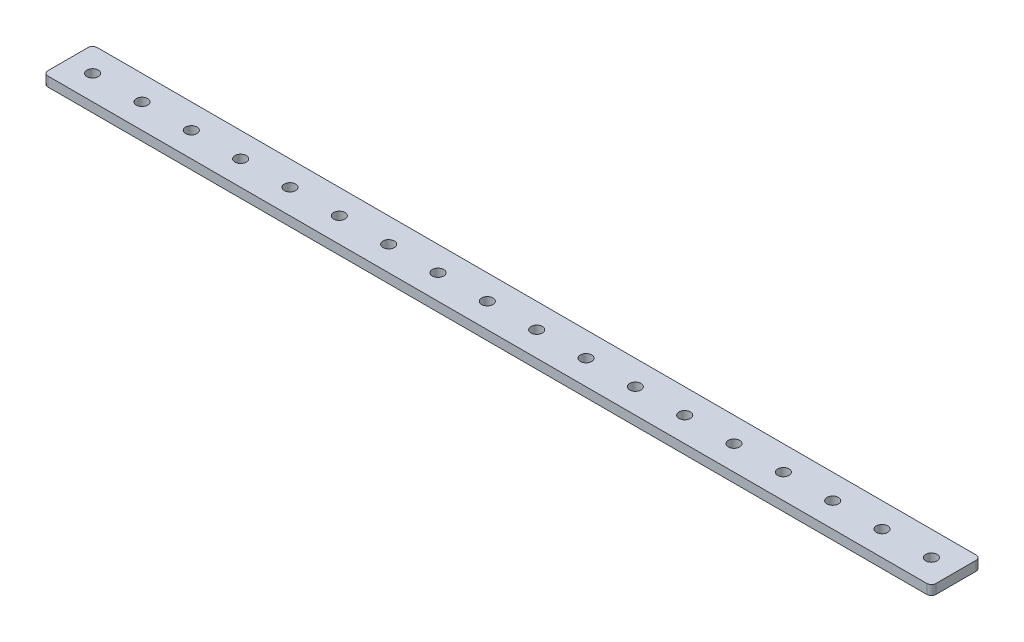
ISO-10303-21;
HEADER;
FILE_DESCRIPTION(('STEP AP214'),'2;1');
FILE_NAME('part.step','',(''),(''),'','','');
FILE_SCHEMA(('AUTOMOTIVE_DESIGN { 1 0 10303 214 1 1 1 1 }'));
ENDSEC;
DATA;
#1=APPLICATION_CONTEXT('core data for automotive mechanical design processes');
#2=APPLICATION_PROTOCOL_DEFINITION('international standard','automotive_design',2000,#1);
#3=PRODUCT_CONTEXT('',#1,'mechanical');
#4=PRODUCT('Part','Part','',(#3));
#5=PRODUCT_RELATED_PRODUCT_CATEGORY('part','',(#4));
#6=PRODUCT_DEFINITION_FORMATION('','',#4);
#7=PRODUCT_DEFINITION_CONTEXT('part definition',#1,'design');
#8=PRODUCT_DEFINITION('design','',#6,#7);
#9=PRODUCT_DEFINITION_SHAPE('','',#8);
#10=(LENGTH_UNIT() NAMED_UNIT(*) SI_UNIT(.MILLI.,.METRE.));
#11=(NAMED_UNIT(*) PLANE_ANGLE_UNIT() SI_UNIT($,.RADIAN.));
#12=(NAMED_UNIT(*) SI_UNIT($,.STERADIAN.) SOLID_ANGLE_UNIT());
#13=UNCERTAINTY_MEASURE_WITH_UNIT(LENGTH_MEASURE(1.E-05),#10,'distance_accuracy_value','');
#14=(GEOMETRIC_REPRESENTATION_CONTEXT(3) GLOBAL_UNCERTAINTY_ASSIGNED_CONTEXT((#13)) GLOBAL_UNIT_ASSIGNED_CONTEXT((#10,
#11,#12)) REPRESENTATION_CONTEXT('',''));
#15=CARTESIAN_POINT('',(0.,0.,0.));
#16=DIRECTION('',(0.,0.,1.));
#17=DIRECTION('',(1.,0.,0.));
#18=AXIS2_PLACEMENT_3D('',#15,#16,#17);
#19=CARTESIAN_POINT('',(-144.,3.1,7.99999999999999));
#20=DIRECTION('',(1.,0.,0.));
#21=DIRECTION('',(0.,0.,-1.));
#22=AXIS2_PLACEMENT_3D('',#19,#20,#21);
#23=PLANE('',#22);
#24=DIRECTION('',(0.,0.,1.));
#25=VECTOR('',#24,1.);
#26=CARTESIAN_POINT('',(-144.,0.,7.99999999999999));
#27=LINE('',#26,#25);
#28=CARTESIAN_POINT('',(-144.,0.,-6.50000000000001));
#29=VERTEX_POINT('',#28);
#30=CARTESIAN_POINT('',(-144.,0.,6.49999999999999));
#31=VERTEX_POINT('',#30);
#32=EDGE_CURVE('E135',#29,#31,#27,.T.);
#33=ORIENTED_EDGE('',*,*,#32,.T.);
#34=DIRECTION('',(0.,-1.,0.));
#35=VECTOR('',#34,1.);
#36=CARTESIAN_POINT('',(-144.,3.1,6.49999999999999));
#37=LINE('',#36,#35);
#38=CARTESIAN_POINT('',(-144.,3.1,6.49999999999999));
#39=VERTEX_POINT('',#38);
#40=EDGE_CURVE('E110',#31,#39,#37,.F.);
#41=ORIENTED_EDGE('',*,*,#40,.T.);
#42=DIRECTION('',(0.,0.,1.));
#43=VECTOR('',#42,1.);
#44=CARTESIAN_POINT('',(-144.,3.1,7.99999999999999));
#45=LINE('',#44,#43);
#46=CARTESIAN_POINT('',(-144.,3.1,-6.50000000000001));
#47=VERTEX_POINT('',#46);
#48=EDGE_CURVE('E150',#47,#39,#45,.T.);
#49=ORIENTED_EDGE('',*,*,#48,.F.);
#50=DIRECTION('',(0.,-1.,0.));
#51=VECTOR('',#50,1.);
#52=CARTESIAN_POINT('',(-144.,3.1,-6.50000000000001));
#53=LINE('',#52,#51);
#54=EDGE_CURVE('E116',#47,#29,#53,.T.);
#55=ORIENTED_EDGE('',*,*,#54,.T.);
#56=EDGE_LOOP('',(#33,#41,#49,#55));
#57=FACE_BOUND('',#56,.T.);
#58=ADVANCED_FACE('F16',(#57),#23,.F.);
#59=CARTESIAN_POINT('',(-144.,3.1,7.99999999999999));
#60=DIRECTION('',(0.,0.,-1.));
#61=DIRECTION('',(-1.,0.,0.));
#62=AXIS2_PLACEMENT_3D('',#59,#60,#61);
#63=PLANE('',#62);
#64=DIRECTION('',(1.,0.,0.));
#65=VECTOR('',#64,1.);
#66=CARTESIAN_POINT('',(-144.,3.1,7.99999999999999));
#67=LINE('',#66,#65);
#68=CARTESIAN_POINT('',(-142.5,3.1,7.99999999999999));
#69=VERTEX_POINT('',#68);
#70=CARTESIAN_POINT('',(142.5,3.1,7.99999999999999));
#71=VERTEX_POINT('',#70);
#72=EDGE_CURVE('E126',#69,#71,#67,.T.);
#73=ORIENTED_EDGE('',*,*,#72,.F.);
#74=DIRECTION('',(0.,-1.,0.));
#75=VECTOR('',#74,1.);
#76=CARTESIAN_POINT('',(-142.5,3.1,7.99999999999999));
#77=LINE('',#76,#75);
#78=CARTESIAN_POINT('',(-142.5,0.,7.99999999999999));
#79=VERTEX_POINT('',#78);
#80=EDGE_CURVE('E109',#69,#79,#77,.T.);
#81=ORIENTED_EDGE('',*,*,#80,.T.);
#82=DIRECTION('',(1.,0.,0.));
#83=VECTOR('',#82,1.);
#84=CARTESIAN_POINT('',(-144.,0.,7.99999999999999));
#85=LINE('',#84,#83);
#86=CARTESIAN_POINT('',(142.5,0.,7.99999999999999));
#87=VERTEX_POINT('',#86);
#88=EDGE_CURVE('E123',#79,#87,#85,.T.);
#89=ORIENTED_EDGE('',*,*,#88,.T.);
#90=DIRECTION('',(0.,-1.,0.));
#91=VECTOR('',#90,1.);
#92=CARTESIAN_POINT('',(142.5,3.1,7.99999999999999));
#93=LINE('',#92,#91);
#94=EDGE_CURVE('E129',#87,#71,#93,.F.);
#95=ORIENTED_EDGE('',*,*,#94,.T.);
#96=EDGE_LOOP('',(#73,#81,#89,#95));
#97=FACE_BOUND('',#96,.T.);
#98=ADVANCED_FACE('F122',(#97),#63,.F.);
#99=CARTESIAN_POINT('',(144.,3.1,7.99999999999999));
#100=DIRECTION('',(-1.,0.,0.));
#101=DIRECTION('',(0.,0.,1.));
#102=AXIS2_PLACEMENT_3D('',#99,#100,#101);
#103=PLANE('',#102);
#104=DIRECTION('',(0.,0.,-1.));
#105=VECTOR('',#104,1.);
#106=CARTESIAN_POINT('',(144.,0.,7.99999999999999));
#107=LINE('',#106,#105);
#108=CARTESIAN_POINT('',(144.,0.,6.49999999999999));
#109=VERTEX_POINT('',#108);
#110=CARTESIAN_POINT('',(144.,0.,-6.50000000000001));
#111=VERTEX_POINT('',#110);
#112=EDGE_CURVE('E134',#109,#111,#107,.T.);
#113=ORIENTED_EDGE('',*,*,#112,.T.);
#114=DIRECTION('',(0.,-1.,0.));
#115=VECTOR('',#114,1.);
#116=CARTESIAN_POINT('',(144.,3.1,-6.50000000000001));
#117=LINE('',#116,#115);
#118=CARTESIAN_POINT('',(144.,3.1,-6.50000000000001));
#119=VERTEX_POINT('',#118);
#120=EDGE_CURVE('E10',#111,#119,#117,.F.);
#121=ORIENTED_EDGE('',*,*,#120,.T.);
#122=DIRECTION('',(0.,0.,-1.));
#123=VECTOR('',#122,1.);
#124=CARTESIAN_POINT('',(144.,3.1,7.99999999999999));
#125=LINE('',#124,#123);
#126=CARTESIAN_POINT('',(144.,3.1,6.49999999999999));
#127=VERTEX_POINT('',#126);
#128=EDGE_CURVE('E190',#127,#119,#125,.T.);
#129=ORIENTED_EDGE('',*,*,#128,.F.);
#130=DIRECTION('',(0.,-1.,0.));
#131=VECTOR('',#130,1.);
#132=CARTESIAN_POINT('',(144.,3.1,6.49999999999999));
#133=LINE('',#132,#131);
#134=EDGE_CURVE('E25',#127,#109,#133,.T.);
#135=ORIENTED_EDGE('',*,*,#134,.T.);
#136=EDGE_LOOP('',(#113,#121,#129,#135));
#137=FACE_BOUND('',#136,.T.);
#138=ADVANCED_FACE('F188',(#137),#103,.F.);
#139=CARTESIAN_POINT('',(-144.,3.1,-8.00000000000001));
#140=DIRECTION('',(0.,0.,1.));
#141=DIRECTION('',(1.,0.,0.));
#142=AXIS2_PLACEMENT_3D('',#139,#140,#141);
#143=PLANE('',#142);
#144=DIRECTION('',(-1.,0.,0.));
#145=VECTOR('',#144,1.);
#146=CARTESIAN_POINT('',(-144.,0.,-8.00000000000001));
#147=LINE('',#146,#145);
#148=CARTESIAN_POINT('',(142.5,0.,-8.00000000000001));
#149=VERTEX_POINT('',#148);
#150=CARTESIAN_POINT('',(-142.5,0.,-8.00000000000001));
#151=VERTEX_POINT('',#150);
#152=EDGE_CURVE('E142',#149,#151,#147,.T.);
#153=ORIENTED_EDGE('',*,*,#152,.T.);
#154=DIRECTION('',(0.,-1.,0.));
#155=VECTOR('',#154,1.);
#156=CARTESIAN_POINT('',(-142.5,3.1,-8.00000000000001));
#157=LINE('',#156,#155);
#158=CARTESIAN_POINT('',(-142.5,3.1,-8.00000000000001));
#159=VERTEX_POINT('',#158);
#160=EDGE_CURVE('E37',#151,#159,#157,.F.);
#161=ORIENTED_EDGE('',*,*,#160,.T.);
#162=DIRECTION('',(-1.,0.,0.));
#163=VECTOR('',#162,1.);
#164=CARTESIAN_POINT('',(-144.,3.1,-8.00000000000001));
#165=LINE('',#164,#163);
#166=CARTESIAN_POINT('',(142.5,3.1,-8.00000000000001));
#167=VERTEX_POINT('',#166);
#168=EDGE_CURVE('E152',#167,#159,#165,.T.);
#169=ORIENTED_EDGE('',*,*,#168,.F.);
#170=DIRECTION('',(0.,-1.,0.));
#171=VECTOR('',#170,1.);
#172=CARTESIAN_POINT('',(142.5,3.1,-8.00000000000001));
#173=LINE('',#172,#171);
#174=EDGE_CURVE('E177',#167,#149,#173,.T.);
#175=ORIENTED_EDGE('',*,*,#174,.T.);
#176=EDGE_LOOP('',(#153,#161,#169,#175));
#177=FACE_BOUND('',#176,.T.);
#178=ADVANCED_FACE('F197',(#177),#143,.F.);
#179=CARTESIAN_POINT('',(-144.,3.1,-8.00000000000001));
#180=DIRECTION('',(0.,-1.,0.));
#181=DIRECTION('',(0.,0.,-1.));
#182=AXIS2_PLACEMENT_3D('',#179,#180,#181);
#183=PLANE('',#182);
#184=CARTESIAN_POINT('',(136.,3.1,0.));
#185=DIRECTION('',(0.,1.,0.));
#186=DIRECTION('',(0.,0.,1.));
#187=AXIS2_PLACEMENT_3D('',#184,#185,#186);
#188=CIRCLE('',#187,1.85);
#189=CARTESIAN_POINT('',(136.,3.1,1.85));
#190=VERTEX_POINT('',#189);
#191=EDGE_CURVE('E343',#190,#190,#188,.T.);
#192=ORIENTED_EDGE('',*,*,#191,.F.);
#193=EDGE_LOOP('',(#192));
#194=FACE_BOUND('',#193,.T.);
#195=CARTESIAN_POINT('',(120.,3.1,0.));
#196=DIRECTION('',(0.,1.,0.));
#197=DIRECTION('',(0.,0.,1.));
#198=AXIS2_PLACEMENT_3D('',#195,#196,#197);
#199=CIRCLE('',#198,1.85);
#200=CARTESIAN_POINT('',(120.,3.1,1.85));
#201=VERTEX_POINT('',#200);
#202=EDGE_CURVE('E335',#201,#201,#199,.T.);
#203=ORIENTED_EDGE('',*,*,#202,.F.);
#204=EDGE_LOOP('',(#203));
#205=FACE_BOUND('',#204,.T.);
#206=CARTESIAN_POINT('',(104.,3.1,0.));
#207=DIRECTION('',(0.,1.,0.));
#208=DIRECTION('',(0.,0.,1.));
#209=AXIS2_PLACEMENT_3D('',#206,#207,#208);
#210=CIRCLE('',#209,1.85);
#211=CARTESIAN_POINT('',(104.,3.1,1.85));
#212=VERTEX_POINT('',#211);
#213=EDGE_CURVE('E327',#212,#212,#210,.T.);
#214=ORIENTED_EDGE('',*,*,#213,.F.);
#215=EDGE_LOOP('',(#214));
#216=FACE_BOUND('',#215,.T.);
#217=CARTESIAN_POINT('',(88.,3.1,0.));
#218=DIRECTION('',(0.,1.,0.));
#219=DIRECTION('',(0.,0.,1.));
#220=AXIS2_PLACEMENT_3D('',#217,#218,#219);
#221=CIRCLE('',#220,1.85);
#222=CARTESIAN_POINT('',(88.,3.1,1.85));
#223=VERTEX_POINT('',#222);
#224=EDGE_CURVE('E319',#223,#223,#221,.T.);
#225=ORIENTED_EDGE('',*,*,#224,.F.);
#226=EDGE_LOOP('',(#225));
#227=FACE_BOUND('',#226,.T.);
#228=CARTESIAN_POINT('',(72.,3.1,0.));
#229=DIRECTION('',(0.,1.,0.));
#230=DIRECTION('',(0.,0.,1.));
#231=AXIS2_PLACEMENT_3D('',#228,#229,#230);
#232=CIRCLE('',#231,1.85);
#233=CARTESIAN_POINT('',(72.,3.1,1.85));
#234=VERTEX_POINT('',#233);
#235=EDGE_CURVE('E311',#234,#234,#232,.T.);
#236=ORIENTED_EDGE('',*,*,#235,.F.);
#237=EDGE_LOOP('',(#236));
#238=FACE_BOUND('',#237,.T.);
#239=CARTESIAN_POINT('',(56.,3.1,0.));
#240=DIRECTION('',(0.,1.,0.));
#241=DIRECTION('',(0.,0.,1.));
#242=AXIS2_PLACEMENT_3D('',#239,#240,#241);
#243=CIRCLE('',#242,1.85);
#244=CARTESIAN_POINT('',(56.,3.1,1.85));
#245=VERTEX_POINT('',#244);
#246=EDGE_CURVE('E303',#245,#245,#243,.T.);
#247=ORIENTED_EDGE('',*,*,#246,.F.);
#248=EDGE_LOOP('',(#247));
#249=FACE_BOUND('',#248,.T.);
#250=CARTESIAN_POINT('',(40.,3.1,0.));
#251=DIRECTION('',(0.,1.,0.));
#252=DIRECTION('',(0.,0.,1.));
#253=AXIS2_PLACEMENT_3D('',#250,#251,#252);
#254=CIRCLE('',#253,1.85);
#255=CARTESIAN_POINT('',(40.,3.1,1.85));
#256=VERTEX_POINT('',#255);
#257=EDGE_CURVE('E295',#256,#256,#254,.T.);
#258=ORIENTED_EDGE('',*,*,#257,.F.);
#259=EDGE_LOOP('',(#258));
#260=FACE_BOUND('',#259,.T.);
#261=CARTESIAN_POINT('',(24.,3.1,0.));
#262=DIRECTION('',(0.,1.,0.));
#263=DIRECTION('',(0.,0.,1.));
#264=AXIS2_PLACEMENT_3D('',#261,#262,#263);
#265=CIRCLE('',#264,1.85);
#266=CARTESIAN_POINT('',(24.,3.1,1.85));
#267=VERTEX_POINT('',#266);
#268=EDGE_CURVE('E287',#267,#267,#265,.T.);
#269=ORIENTED_EDGE('',*,*,#268,.F.);
#270=EDGE_LOOP('',(#269));
#271=FACE_BOUND('',#270,.T.);
#272=CARTESIAN_POINT('',(8.00000000000004,3.1,0.));
#273=DIRECTION('',(0.,1.,0.));
#274=DIRECTION('',(0.,0.,1.));
#275=AXIS2_PLACEMENT_3D('',#272,#273,#274);
#276=CIRCLE('',#275,1.85);
#277=CARTESIAN_POINT('',(8.00000000000004,3.1,1.85));
#278=VERTEX_POINT('',#277);
#279=EDGE_CURVE('E279',#278,#278,#276,.T.);
#280=ORIENTED_EDGE('',*,*,#279,.F.);
#281=EDGE_LOOP('',(#280));
#282=FACE_BOUND('',#281,.T.);
#283=CARTESIAN_POINT('',(-7.99999999999998,3.1,0.));
#284=DIRECTION('',(0.,1.,0.));
#285=DIRECTION('',(0.,0.,1.));
#286=AXIS2_PLACEMENT_3D('',#283,#284,#285);
#287=CIRCLE('',#286,1.85);
#288=CARTESIAN_POINT('',(-7.99999999999998,3.1,1.85));
#289=VERTEX_POINT('',#288);
#290=EDGE_CURVE('E271',#289,#289,#287,.T.);
#291=ORIENTED_EDGE('',*,*,#290,.F.);
#292=EDGE_LOOP('',(#291));
#293=FACE_BOUND('',#292,.T.);
#294=CARTESIAN_POINT('',(-24.,3.1,0.));
#295=DIRECTION('',(0.,1.,0.));
#296=DIRECTION('',(0.,0.,1.));
#297=AXIS2_PLACEMENT_3D('',#294,#295,#296);
#298=CIRCLE('',#297,1.85);
#299=CARTESIAN_POINT('',(-24.,3.1,1.85));
#300=VERTEX_POINT('',#299);
#301=EDGE_CURVE('E263',#300,#300,#298,.T.);
#302=ORIENTED_EDGE('',*,*,#301,.F.);
#303=EDGE_LOOP('',(#302));
#304=FACE_BOUND('',#303,.T.);
#305=CARTESIAN_POINT('',(-40.,3.1,0.));
#306=DIRECTION('',(0.,1.,0.));
#307=DIRECTION('',(0.,0.,1.));
#308=AXIS2_PLACEMENT_3D('',#305,#306,#307);
#309=CIRCLE('',#308,1.85);
#310=CARTESIAN_POINT('',(-40.,3.1,1.85));
#311=VERTEX_POINT('',#310);
#312=EDGE_CURVE('E255',#311,#311,#309,.T.);
#313=ORIENTED_EDGE('',*,*,#312,.F.);
#314=EDGE_LOOP('',(#313));
#315=FACE_BOUND('',#314,.T.);
#316=CARTESIAN_POINT('',(-56.,3.1,0.));
#317=DIRECTION('',(0.,1.,0.));
#318=DIRECTION('',(0.,0.,1.));
#319=AXIS2_PLACEMENT_3D('',#316,#317,#318);
#320=CIRCLE('',#319,1.85);
#321=CARTESIAN_POINT('',(-56.,3.1,1.85));
#322=VERTEX_POINT('',#321);
#323=EDGE_CURVE('E247',#322,#322,#320,.T.);
#324=ORIENTED_EDGE('',*,*,#323,.F.);
#325=EDGE_LOOP('',(#324));
#326=FACE_BOUND('',#325,.T.);
#327=CARTESIAN_POINT('',(-72.,3.1,0.));
#328=DIRECTION('',(0.,1.,0.));
#329=DIRECTION('',(0.,0.,1.));
#330=AXIS2_PLACEMENT_3D('',#327,#328,#329);
#331=CIRCLE('',#330,1.85);
#332=CARTESIAN_POINT('',(-72.,3.1,1.85));
#333=VERTEX_POINT('',#332);
#334=EDGE_CURVE('E239',#333,#333,#331,.T.);
#335=ORIENTED_EDGE('',*,*,#334,.F.);
#336=EDGE_LOOP('',(#335));
#337=FACE_BOUND('',#336,.T.);
#338=CARTESIAN_POINT('',(-88.,3.1,0.));
#339=DIRECTION('',(0.,1.,0.));
#340=DIRECTION('',(0.,0.,1.));
#341=AXIS2_PLACEMENT_3D('',#338,#339,#340);
#342=CIRCLE('',#341,1.85);
#343=CARTESIAN_POINT('',(-88.,3.1,1.85));
#344=VERTEX_POINT('',#343);
#345=EDGE_CURVE('E231',#344,#344,#342,.T.);
#346=ORIENTED_EDGE('',*,*,#345,.F.);
#347=EDGE_LOOP('',(#346));
#348=FACE_BOUND('',#347,.T.);
#349=CARTESIAN_POINT('',(-104.,3.1,0.));
#350=DIRECTION('',(0.,1.,0.));
#351=DIRECTION('',(0.,0.,1.));
#352=AXIS2_PLACEMENT_3D('',#349,#350,#351);
#353=CIRCLE('',#352,1.85);
#354=CARTESIAN_POINT('',(-104.,3.1,1.85));
#355=VERTEX_POINT('',#354);
#356=EDGE_CURVE('E223',#355,#355,#353,.T.);
#357=ORIENTED_EDGE('',*,*,#356,.F.);
#358=EDGE_LOOP('',(#357));
#359=FACE_BOUND('',#358,.T.);
#360=CARTESIAN_POINT('',(-120.,3.1,0.));
#361=DIRECTION('',(0.,1.,0.));
#362=DIRECTION('',(0.,0.,1.));
#363=AXIS2_PLACEMENT_3D('',#360,#361,#362);
#364=CIRCLE('',#363,1.85);
#365=CARTESIAN_POINT('',(-120.,3.1,1.85));
#366=VERTEX_POINT('',#365);
#367=EDGE_CURVE('E215',#366,#366,#364,.T.);
#368=ORIENTED_EDGE('',*,*,#367,.F.);
#369=EDGE_LOOP('',(#368));
#370=FACE_BOUND('',#369,.T.);
#371=CARTESIAN_POINT('',(-136.,3.1,0.));
#372=DIRECTION('',(0.,1.,0.));
#373=DIRECTION('',(0.,0.,1.));
#374=AXIS2_PLACEMENT_3D('',#371,#372,#373);
#375=CIRCLE('',#374,1.85);
#376=CARTESIAN_POINT('',(-136.,3.1,1.85));
#377=VERTEX_POINT('',#376);
#378=EDGE_CURVE('E144',#377,#377,#375,.T.);
#379=ORIENTED_EDGE('',*,*,#378,.F.);
#380=EDGE_LOOP('',(#379));
#381=FACE_BOUND('',#380,.T.);
#382=ORIENTED_EDGE('',*,*,#48,.T.);
#383=CARTESIAN_POINT('',(-142.5,3.1,6.49999999999999));
#384=DIRECTION('',(0.,-1.,0.));
#385=DIRECTION('',(0.,0.,-1.));
#386=AXIS2_PLACEMENT_3D('',#383,#384,#385);
#387=CIRCLE('',#386,1.5);
#388=EDGE_CURVE('E174',#39,#69,#387,.F.);
#389=ORIENTED_EDGE('',*,*,#388,.T.);
#390=ORIENTED_EDGE('',*,*,#72,.T.);
#391=CARTESIAN_POINT('',(142.5,3.1,6.49999999999999));
#392=DIRECTION('',(0.,-1.,0.));
#393=DIRECTION('',(0.,0.,-1.));
#394=AXIS2_PLACEMENT_3D('',#391,#392,#393);
#395=CIRCLE('',#394,1.5);
#396=EDGE_CURVE('E166',#71,#127,#395,.F.);
#397=ORIENTED_EDGE('',*,*,#396,.T.);
#398=ORIENTED_EDGE('',*,*,#128,.T.);
#399=CARTESIAN_POINT('',(142.5,3.1,-6.50000000000001));
#400=DIRECTION('',(0.,-1.,0.));
#401=DIRECTION('',(0.,0.,-1.));
#402=AXIS2_PLACEMENT_3D('',#399,#400,#401);
#403=CIRCLE('',#402,1.5);
#404=EDGE_CURVE('E46',#119,#167,#403,.F.);
#405=ORIENTED_EDGE('',*,*,#404,.T.);
#406=ORIENTED_EDGE('',*,*,#168,.T.);
#407=CARTESIAN_POINT('',(-142.5,3.1,-6.50000000000001));
#408=DIRECTION('',(0.,-1.,0.));
#409=DIRECTION('',(0.,0.,-1.));
#410=AXIS2_PLACEMENT_3D('',#407,#408,#409);
#411=CIRCLE('',#410,1.5);
#412=EDGE_CURVE('E171',#159,#47,#411,.F.);
#413=ORIENTED_EDGE('',*,*,#412,.T.);
#414=EDGE_LOOP('',(#382,#389,#390,#397,#398,#405,#406,#413));
#415=FACE_BOUND('',#414,.T.);
#416=ADVANCED_FACE('F364',(#194,#205,#216,#227,#238,#249,#260,#271,#282,#293,#304,#315,#326,
#337,#348,#359,#370,#381,#415),#183,.F.);
#417=CARTESIAN_POINT('',(-144.,0.,-8.00000000000001));
#418=DIRECTION('',(0.,-1.,0.));
#419=DIRECTION('',(0.,0.,-1.));
#420=AXIS2_PLACEMENT_3D('',#417,#418,#419);
#421=PLANE('',#420);
#422=CARTESIAN_POINT('',(136.,0.,0.));
#423=DIRECTION('',(0.,1.,0.));
#424=DIRECTION('',(0.,0.,1.));
#425=AXIS2_PLACEMENT_3D('',#422,#423,#424);
#426=CIRCLE('',#425,1.85);
#427=CARTESIAN_POINT('',(136.,0.,1.85));
#428=VERTEX_POINT('',#427);
#429=EDGE_CURVE('E347',#428,#428,#426,.T.);
#430=ORIENTED_EDGE('',*,*,#429,.T.);
#431=EDGE_LOOP('',(#430));
#432=FACE_BOUND('',#431,.T.);
#433=CARTESIAN_POINT('',(120.,0.,0.));
#434=DIRECTION('',(0.,1.,0.));
#435=DIRECTION('',(0.,0.,1.));
#436=AXIS2_PLACEMENT_3D('',#433,#434,#435);
#437=CIRCLE('',#436,1.85);
#438=CARTESIAN_POINT('',(120.,0.,1.85));
#439=VERTEX_POINT('',#438);
#440=EDGE_CURVE('E339',#439,#439,#437,.T.);
#441=ORIENTED_EDGE('',*,*,#440,.T.);
#442=EDGE_LOOP('',(#441));
#443=FACE_BOUND('',#442,.T.);
#444=CARTESIAN_POINT('',(104.,0.,0.));
#445=DIRECTION('',(0.,1.,0.));
#446=DIRECTION('',(0.,0.,1.));
#447=AXIS2_PLACEMENT_3D('',#444,#445,#446);
#448=CIRCLE('',#447,1.85);
#449=CARTESIAN_POINT('',(104.,0.,1.85));
#450=VERTEX_POINT('',#449);
#451=EDGE_CURVE('E331',#450,#450,#448,.T.);
#452=ORIENTED_EDGE('',*,*,#451,.T.);
#453=EDGE_LOOP('',(#452));
#454=FACE_BOUND('',#453,.T.);
#455=CARTESIAN_POINT('',(88.,0.,0.));
#456=DIRECTION('',(0.,1.,0.));
#457=DIRECTION('',(0.,0.,1.));
#458=AXIS2_PLACEMENT_3D('',#455,#456,#457);
#459=CIRCLE('',#458,1.85);
#460=CARTESIAN_POINT('',(88.,0.,1.85));
#461=VERTEX_POINT('',#460);
#462=EDGE_CURVE('E323',#461,#461,#459,.T.);
#463=ORIENTED_EDGE('',*,*,#462,.T.);
#464=EDGE_LOOP('',(#463));
#465=FACE_BOUND('',#464,.T.);
#466=CARTESIAN_POINT('',(72.,0.,0.));
#467=DIRECTION('',(0.,1.,0.));
#468=DIRECTION('',(0.,0.,1.));
#469=AXIS2_PLACEMENT_3D('',#466,#467,#468);
#470=CIRCLE('',#469,1.85);
#471=CARTESIAN_POINT('',(72.,0.,1.85));
#472=VERTEX_POINT('',#471);
#473=EDGE_CURVE('E315',#472,#472,#470,.T.);
#474=ORIENTED_EDGE('',*,*,#473,.T.);
#475=EDGE_LOOP('',(#474));
#476=FACE_BOUND('',#475,.T.);
#477=CARTESIAN_POINT('',(56.,0.,0.));
#478=DIRECTION('',(0.,1.,0.));
#479=DIRECTION('',(0.,0.,1.));
#480=AXIS2_PLACEMENT_3D('',#477,#478,#479);
#481=CIRCLE('',#480,1.85);
#482=CARTESIAN_POINT('',(56.,0.,1.85));
#483=VERTEX_POINT('',#482);
#484=EDGE_CURVE('E307',#483,#483,#481,.T.);
#485=ORIENTED_EDGE('',*,*,#484,.T.);
#486=EDGE_LOOP('',(#485));
#487=FACE_BOUND('',#486,.T.);
#488=CARTESIAN_POINT('',(40.,0.,0.));
#489=DIRECTION('',(0.,1.,0.));
#490=DIRECTION('',(0.,0.,1.));
#491=AXIS2_PLACEMENT_3D('',#488,#489,#490);
#492=CIRCLE('',#491,1.85);
#493=CARTESIAN_POINT('',(40.,0.,1.85));
#494=VERTEX_POINT('',#493);
#495=EDGE_CURVE('E299',#494,#494,#492,.T.);
#496=ORIENTED_EDGE('',*,*,#495,.T.);
#497=EDGE_LOOP('',(#496));
#498=FACE_BOUND('',#497,.T.);
#499=CARTESIAN_POINT('',(24.,0.,0.));
#500=DIRECTION('',(0.,1.,0.));
#501=DIRECTION('',(0.,0.,1.));
#502=AXIS2_PLACEMENT_3D('',#499,#500,#501);
#503=CIRCLE('',#502,1.85);
#504=CARTESIAN_POINT('',(24.,0.,1.85));
#505=VERTEX_POINT('',#504);
#506=EDGE_CURVE('E291',#505,#505,#503,.T.);
#507=ORIENTED_EDGE('',*,*,#506,.T.);
#508=EDGE_LOOP('',(#507));
#509=FACE_BOUND('',#508,.T.);
#510=CARTESIAN_POINT('',(8.00000000000004,0.,0.));
#511=DIRECTION('',(0.,1.,0.));
#512=DIRECTION('',(0.,0.,1.));
#513=AXIS2_PLACEMENT_3D('',#510,#511,#512);
#514=CIRCLE('',#513,1.85);
#515=CARTESIAN_POINT('',(8.00000000000004,0.,1.85));
#516=VERTEX_POINT('',#515);
#517=EDGE_CURVE('E283',#516,#516,#514,.T.);
#518=ORIENTED_EDGE('',*,*,#517,.T.);
#519=EDGE_LOOP('',(#518));
#520=FACE_BOUND('',#519,.T.);
#521=CARTESIAN_POINT('',(-7.99999999999998,0.,0.));
#522=DIRECTION('',(0.,1.,0.));
#523=DIRECTION('',(0.,0.,1.));
#524=AXIS2_PLACEMENT_3D('',#521,#522,#523);
#525=CIRCLE('',#524,1.85);
#526=CARTESIAN_POINT('',(-7.99999999999998,0.,1.85));
#527=VERTEX_POINT('',#526);
#528=EDGE_CURVE('E275',#527,#527,#525,.T.);
#529=ORIENTED_EDGE('',*,*,#528,.T.);
#530=EDGE_LOOP('',(#529));
#531=FACE_BOUND('',#530,.T.);
#532=CARTESIAN_POINT('',(-24.,0.,0.));
#533=DIRECTION('',(0.,1.,0.));
#534=DIRECTION('',(0.,0.,1.));
#535=AXIS2_PLACEMENT_3D('',#532,#533,#534);
#536=CIRCLE('',#535,1.85);
#537=CARTESIAN_POINT('',(-24.,0.,1.85));
#538=VERTEX_POINT('',#537);
#539=EDGE_CURVE('E267',#538,#538,#536,.T.);
#540=ORIENTED_EDGE('',*,*,#539,.T.);
#541=EDGE_LOOP('',(#540));
#542=FACE_BOUND('',#541,.T.);
#543=CARTESIAN_POINT('',(-40.,0.,0.));
#544=DIRECTION('',(0.,1.,0.));
#545=DIRECTION('',(0.,0.,1.));
#546=AXIS2_PLACEMENT_3D('',#543,#544,#545);
#547=CIRCLE('',#546,1.85);
#548=CARTESIAN_POINT('',(-40.,0.,1.85));
#549=VERTEX_POINT('',#548);
#550=EDGE_CURVE('E259',#549,#549,#547,.T.);
#551=ORIENTED_EDGE('',*,*,#550,.T.);
#552=EDGE_LOOP('',(#551));
#553=FACE_BOUND('',#552,.T.);
#554=CARTESIAN_POINT('',(-56.,0.,0.));
#555=DIRECTION('',(0.,1.,0.));
#556=DIRECTION('',(0.,0.,1.));
#557=AXIS2_PLACEMENT_3D('',#554,#555,#556);
#558=CIRCLE('',#557,1.85);
#559=CARTESIAN_POINT('',(-56.,0.,1.85));
#560=VERTEX_POINT('',#559);
#561=EDGE_CURVE('E251',#560,#560,#558,.T.);
#562=ORIENTED_EDGE('',*,*,#561,.T.);
#563=EDGE_LOOP('',(#562));
#564=FACE_BOUND('',#563,.T.);
#565=CARTESIAN_POINT('',(-72.,0.,0.));
#566=DIRECTION('',(0.,1.,0.));
#567=DIRECTION('',(0.,0.,1.));
#568=AXIS2_PLACEMENT_3D('',#565,#566,#567);
#569=CIRCLE('',#568,1.85);
#570=CARTESIAN_POINT('',(-72.,0.,1.85));
#571=VERTEX_POINT('',#570);
#572=EDGE_CURVE('E243',#571,#571,#569,.T.);
#573=ORIENTED_EDGE('',*,*,#572,.T.);
#574=EDGE_LOOP('',(#573));
#575=FACE_BOUND('',#574,.T.);
#576=CARTESIAN_POINT('',(-88.,0.,0.));
#577=DIRECTION('',(0.,1.,0.));
#578=DIRECTION('',(0.,0.,1.));
#579=AXIS2_PLACEMENT_3D('',#576,#577,#578);
#580=CIRCLE('',#579,1.85);
#581=CARTESIAN_POINT('',(-88.,0.,1.85));
#582=VERTEX_POINT('',#581);
#583=EDGE_CURVE('E235',#582,#582,#580,.T.);
#584=ORIENTED_EDGE('',*,*,#583,.T.);
#585=EDGE_LOOP('',(#584));
#586=FACE_BOUND('',#585,.T.);
#587=CARTESIAN_POINT('',(-104.,0.,0.));
#588=DIRECTION('',(0.,1.,0.));
#589=DIRECTION('',(0.,0.,1.));
#590=AXIS2_PLACEMENT_3D('',#587,#588,#589);
#591=CIRCLE('',#590,1.85);
#592=CARTESIAN_POINT('',(-104.,0.,1.85));
#593=VERTEX_POINT('',#592);
#594=EDGE_CURVE('E227',#593,#593,#591,.T.);
#595=ORIENTED_EDGE('',*,*,#594,.T.);
#596=EDGE_LOOP('',(#595));
#597=FACE_BOUND('',#596,.T.);
#598=CARTESIAN_POINT('',(-120.,0.,0.));
#599=DIRECTION('',(0.,1.,0.));
#600=DIRECTION('',(0.,0.,1.));
#601=AXIS2_PLACEMENT_3D('',#598,#599,#600);
#602=CIRCLE('',#601,1.85);
#603=CARTESIAN_POINT('',(-120.,0.,1.85));
#604=VERTEX_POINT('',#603);
#605=EDGE_CURVE('E219',#604,#604,#602,.T.);
#606=ORIENTED_EDGE('',*,*,#605,.T.);
#607=EDGE_LOOP('',(#606));
#608=FACE_BOUND('',#607,.T.);
#609=CARTESIAN_POINT('',(-136.,0.,0.));
#610=DIRECTION('',(0.,1.,0.));
#611=DIRECTION('',(0.,0.,1.));
#612=AXIS2_PLACEMENT_3D('',#609,#610,#611);
#613=CIRCLE('',#612,1.85);
#614=CARTESIAN_POINT('',(-136.,0.,1.85));
#615=VERTEX_POINT('',#614);
#616=EDGE_CURVE('E211',#615,#615,#613,.T.);
#617=ORIENTED_EDGE('',*,*,#616,.T.);
#618=EDGE_LOOP('',(#617));
#619=FACE_BOUND('',#618,.T.);
#620=ORIENTED_EDGE('',*,*,#88,.F.);
#621=CARTESIAN_POINT('',(-142.5,0.,6.49999999999999));
#622=DIRECTION('',(0.,-1.,0.));
#623=DIRECTION('',(0.,0.,-1.));
#624=AXIS2_PLACEMENT_3D('',#621,#622,#623);
#625=CIRCLE('',#624,1.5);
#626=EDGE_CURVE('E105',#79,#31,#625,.T.);
#627=ORIENTED_EDGE('',*,*,#626,.T.);
#628=ORIENTED_EDGE('',*,*,#32,.F.);
#629=CARTESIAN_POINT('',(-142.5,0.,-6.50000000000001));
#630=DIRECTION('',(0.,-1.,0.));
#631=DIRECTION('',(0.,0.,-1.));
#632=AXIS2_PLACEMENT_3D('',#629,#630,#631);
#633=CIRCLE('',#632,1.5);
#634=EDGE_CURVE('E117',#29,#151,#633,.T.);
#635=ORIENTED_EDGE('',*,*,#634,.T.);
#636=ORIENTED_EDGE('',*,*,#152,.F.);
#637=CARTESIAN_POINT('',(142.5,0.,-6.50000000000001));
#638=DIRECTION('',(0.,-1.,0.));
#639=DIRECTION('',(0.,0.,-1.));
#640=AXIS2_PLACEMENT_3D('',#637,#638,#639);
#641=CIRCLE('',#640,1.5);
#642=EDGE_CURVE('E156',#149,#111,#641,.T.);
#643=ORIENTED_EDGE('',*,*,#642,.T.);
#644=ORIENTED_EDGE('',*,*,#112,.F.);
#645=CARTESIAN_POINT('',(142.5,0.,6.49999999999999));
#646=DIRECTION('',(0.,-1.,0.));
#647=DIRECTION('',(0.,0.,-1.));
#648=AXIS2_PLACEMENT_3D('',#645,#646,#647);
#649=CIRCLE('',#648,1.5);
#650=EDGE_CURVE('E128',#109,#87,#649,.T.);
#651=ORIENTED_EDGE('',*,*,#650,.T.);
#652=EDGE_LOOP('',(#620,#627,#628,#635,#636,#643,#644,#651));
#653=FACE_BOUND('',#652,.T.);
#654=ADVANCED_FACE('F131',(#432,#443,#454,#465,#476,#487,#498,#509,#520,#531,#542,#553,#564,
#575,#586,#597,#608,#619,#653),#421,.T.);
#655=CARTESIAN_POINT('',(-142.5,3.1,6.49999999999999));
#656=DIRECTION('',(0.,-1.,0.));
#657=DIRECTION('',(0.,0.,-1.));
#658=AXIS2_PLACEMENT_3D('',#655,#656,#657);
#659=CYLINDRICAL_SURFACE('',#658,1.5);
#660=ORIENTED_EDGE('',*,*,#388,.F.);
#661=ORIENTED_EDGE('',*,*,#40,.F.);
#662=ORIENTED_EDGE('',*,*,#626,.F.);
#663=ORIENTED_EDGE('',*,*,#80,.F.);
#664=EDGE_LOOP('',(#660,#661,#662,#663));
#665=FACE_BOUND('',#664,.T.);
#666=ADVANCED_FACE('F108',(#665),#659,.T.);
#667=CARTESIAN_POINT('',(-142.5,3.1,-6.50000000000001));
#668=DIRECTION('',(0.,-1.,0.));
#669=DIRECTION('',(0.,0.,-1.));
#670=AXIS2_PLACEMENT_3D('',#667,#668,#669);
#671=CYLINDRICAL_SURFACE('',#670,1.5);
#672=ORIENTED_EDGE('',*,*,#412,.F.);
#673=ORIENTED_EDGE('',*,*,#160,.F.);
#674=ORIENTED_EDGE('',*,*,#634,.F.);
#675=ORIENTED_EDGE('',*,*,#54,.F.);
#676=EDGE_LOOP('',(#672,#673,#674,#675));
#677=FACE_BOUND('',#676,.T.);
#678=ADVANCED_FACE('F405',(#677),#671,.T.);
#679=CARTESIAN_POINT('',(142.5,3.1,-6.50000000000001));
#680=DIRECTION('',(0.,-1.,0.));
#681=DIRECTION('',(0.,0.,-1.));
#682=AXIS2_PLACEMENT_3D('',#679,#680,#681);
#683=CYLINDRICAL_SURFACE('',#682,1.5);
#684=ORIENTED_EDGE('',*,*,#404,.F.);
#685=ORIENTED_EDGE('',*,*,#120,.F.);
#686=ORIENTED_EDGE('',*,*,#642,.F.);
#687=ORIENTED_EDGE('',*,*,#174,.F.);
#688=EDGE_LOOP('',(#684,#685,#686,#687));
#689=FACE_BOUND('',#688,.T.);
#690=ADVANCED_FACE('F196',(#689),#683,.T.);
#691=CARTESIAN_POINT('',(142.5,3.1,6.49999999999999));
#692=DIRECTION('',(0.,-1.,0.));
#693=DIRECTION('',(0.,0.,-1.));
#694=AXIS2_PLACEMENT_3D('',#691,#692,#693);
#695=CYLINDRICAL_SURFACE('',#694,1.5);
#696=ORIENTED_EDGE('',*,*,#396,.F.);
#697=ORIENTED_EDGE('',*,*,#94,.F.);
#698=ORIENTED_EDGE('',*,*,#650,.F.);
#699=ORIENTED_EDGE('',*,*,#134,.F.);
#700=EDGE_LOOP('',(#696,#697,#698,#699));
#701=FACE_BOUND('',#700,.T.);
#702=ADVANCED_FACE('F18',(#701),#695,.T.);
#703=CARTESIAN_POINT('',(-136.,0.,0.));
#704=DIRECTION('',(0.,1.,0.));
#705=DIRECTION('',(0.,0.,1.));
#706=AXIS2_PLACEMENT_3D('',#703,#704,#705);
#707=CYLINDRICAL_SURFACE('',#706,1.85);
#708=ORIENTED_EDGE('',*,*,#616,.F.);
#709=EDGE_LOOP('',(#708));
#710=FACE_BOUND('',#709,.T.);
#711=ORIENTED_EDGE('',*,*,#378,.T.);
#712=EDGE_LOOP('',(#711));
#713=FACE_BOUND('',#712,.T.);
#714=ADVANCED_FACE('F427',(#710,#713),#707,.F.);
#715=CARTESIAN_POINT('',(-120.,0.,0.));
#716=DIRECTION('',(0.,1.,0.));
#717=DIRECTION('',(0.,0.,1.));
#718=AXIS2_PLACEMENT_3D('',#715,#716,#717);
#719=CYLINDRICAL_SURFACE('',#718,1.85);
#720=ORIENTED_EDGE('',*,*,#605,.F.);
#721=EDGE_LOOP('',(#720));
#722=FACE_BOUND('',#721,.T.);
#723=ORIENTED_EDGE('',*,*,#367,.T.);
#724=EDGE_LOOP('',(#723));
#725=FACE_BOUND('',#724,.T.);
#726=ADVANCED_FACE('F430',(#722,#725),#719,.F.);
#727=CARTESIAN_POINT('',(-104.,0.,0.));
#728=DIRECTION('',(0.,1.,0.));
#729=DIRECTION('',(0.,0.,1.));
#730=AXIS2_PLACEMENT_3D('',#727,#728,#729);
#731=CYLINDRICAL_SURFACE('',#730,1.85);
#732=ORIENTED_EDGE('',*,*,#594,.F.);
#733=EDGE_LOOP('',(#732));
#734=FACE_BOUND('',#733,.T.);
#735=ORIENTED_EDGE('',*,*,#356,.T.);
#736=EDGE_LOOP('',(#735));
#737=FACE_BOUND('',#736,.T.);
#738=ADVANCED_FACE('F434',(#734,#737),#731,.F.);
#739=CARTESIAN_POINT('',(-88.,0.,0.));
#740=DIRECTION('',(0.,1.,0.));
#741=DIRECTION('',(0.,0.,1.));
#742=AXIS2_PLACEMENT_3D('',#739,#740,#741);
#743=CYLINDRICAL_SURFACE('',#742,1.85);
#744=ORIENTED_EDGE('',*,*,#583,.F.);
#745=EDGE_LOOP('',(#744));
#746=FACE_BOUND('',#745,.T.);
#747=ORIENTED_EDGE('',*,*,#345,.T.);
#748=EDGE_LOOP('',(#747));
#749=FACE_BOUND('',#748,.T.);
#750=ADVANCED_FACE('F438',(#746,#749),#743,.F.);
#751=CARTESIAN_POINT('',(-72.,0.,0.));
#752=DIRECTION('',(0.,1.,0.));
#753=DIRECTION('',(0.,0.,1.));
#754=AXIS2_PLACEMENT_3D('',#751,#752,#753);
#755=CYLINDRICAL_SURFACE('',#754,1.85);
#756=ORIENTED_EDGE('',*,*,#572,.F.);
#757=EDGE_LOOP('',(#756));
#758=FACE_BOUND('',#757,.T.);
#759=ORIENTED_EDGE('',*,*,#334,.T.);
#760=EDGE_LOOP('',(#759));
#761=FACE_BOUND('',#760,.T.);
#762=ADVANCED_FACE('F442',(#758,#761),#755,.F.);
#763=CARTESIAN_POINT('',(-56.,0.,0.));
#764=DIRECTION('',(0.,1.,0.));
#765=DIRECTION('',(0.,0.,1.));
#766=AXIS2_PLACEMENT_3D('',#763,#764,#765);
#767=CYLINDRICAL_SURFACE('',#766,1.85);
#768=ORIENTED_EDGE('',*,*,#561,.F.);
#769=EDGE_LOOP('',(#768));
#770=FACE_BOUND('',#769,.T.);
#771=ORIENTED_EDGE('',*,*,#323,.T.);
#772=EDGE_LOOP('',(#771));
#773=FACE_BOUND('',#772,.T.);
#774=ADVANCED_FACE('F446',(#770,#773),#767,.F.);
#775=CARTESIAN_POINT('',(-40.,0.,0.));
#776=DIRECTION('',(0.,1.,0.));
#777=DIRECTION('',(0.,0.,1.));
#778=AXIS2_PLACEMENT_3D('',#775,#776,#777);
#779=CYLINDRICAL_SURFACE('',#778,1.85);
#780=ORIENTED_EDGE('',*,*,#550,.F.);
#781=EDGE_LOOP('',(#780));
#782=FACE_BOUND('',#781,.T.);
#783=ORIENTED_EDGE('',*,*,#312,.T.);
#784=EDGE_LOOP('',(#783));
#785=FACE_BOUND('',#784,.T.);
#786=ADVANCED_FACE('F450',(#782,#785),#779,.F.);
#787=CARTESIAN_POINT('',(-24.,0.,0.));
#788=DIRECTION('',(0.,1.,0.));
#789=DIRECTION('',(0.,0.,1.));
#790=AXIS2_PLACEMENT_3D('',#787,#788,#789);
#791=CYLINDRICAL_SURFACE('',#790,1.85);
#792=ORIENTED_EDGE('',*,*,#539,.F.);
#793=EDGE_LOOP('',(#792));
#794=FACE_BOUND('',#793,.T.);
#795=ORIENTED_EDGE('',*,*,#301,.T.);
#796=EDGE_LOOP('',(#795));
#797=FACE_BOUND('',#796,.T.);
#798=ADVANCED_FACE('F454',(#794,#797),#791,.F.);
#799=CARTESIAN_POINT('',(-7.99999999999998,0.,0.));
#800=DIRECTION('',(0.,1.,0.));
#801=DIRECTION('',(0.,0.,1.));
#802=AXIS2_PLACEMENT_3D('',#799,#800,#801);
#803=CYLINDRICAL_SURFACE('',#802,1.85);
#804=ORIENTED_EDGE('',*,*,#528,.F.);
#805=EDGE_LOOP('',(#804));
#806=FACE_BOUND('',#805,.T.);
#807=ORIENTED_EDGE('',*,*,#290,.T.);
#808=EDGE_LOOP('',(#807));
#809=FACE_BOUND('',#808,.T.);
#810=ADVANCED_FACE('F458',(#806,#809),#803,.F.);
#811=CARTESIAN_POINT('',(8.00000000000004,0.,0.));
#812=DIRECTION('',(0.,1.,0.));
#813=DIRECTION('',(0.,0.,1.));
#814=AXIS2_PLACEMENT_3D('',#811,#812,#813);
#815=CYLINDRICAL_SURFACE('',#814,1.85);
#816=ORIENTED_EDGE('',*,*,#517,.F.);
#817=EDGE_LOOP('',(#816));
#818=FACE_BOUND('',#817,.T.);
#819=ORIENTED_EDGE('',*,*,#279,.T.);
#820=EDGE_LOOP('',(#819));
#821=FACE_BOUND('',#820,.T.);
#822=ADVANCED_FACE('F462',(#818,#821),#815,.F.);
#823=CARTESIAN_POINT('',(24.,0.,0.));
#824=DIRECTION('',(0.,1.,0.));
#825=DIRECTION('',(0.,0.,1.));
#826=AXIS2_PLACEMENT_3D('',#823,#824,#825);
#827=CYLINDRICAL_SURFACE('',#826,1.85);
#828=ORIENTED_EDGE('',*,*,#506,.F.);
#829=EDGE_LOOP('',(#828));
#830=FACE_BOUND('',#829,.T.);
#831=ORIENTED_EDGE('',*,*,#268,.T.);
#832=EDGE_LOOP('',(#831));
#833=FACE_BOUND('',#832,.T.);
#834=ADVANCED_FACE('F466',(#830,#833),#827,.F.);
#835=CARTESIAN_POINT('',(40.,0.,0.));
#836=DIRECTION('',(0.,1.,0.));
#837=DIRECTION('',(0.,0.,1.));
#838=AXIS2_PLACEMENT_3D('',#835,#836,#837);
#839=CYLINDRICAL_SURFACE('',#838,1.85);
#840=ORIENTED_EDGE('',*,*,#495,.F.);
#841=EDGE_LOOP('',(#840));
#842=FACE_BOUND('',#841,.T.);
#843=ORIENTED_EDGE('',*,*,#257,.T.);
#844=EDGE_LOOP('',(#843));
#845=FACE_BOUND('',#844,.T.);
#846=ADVANCED_FACE('F470',(#842,#845),#839,.F.);
#847=CARTESIAN_POINT('',(56.,0.,0.));
#848=DIRECTION('',(0.,1.,0.));
#849=DIRECTION('',(0.,0.,1.));
#850=AXIS2_PLACEMENT_3D('',#847,#848,#849);
#851=CYLINDRICAL_SURFACE('',#850,1.85);
#852=ORIENTED_EDGE('',*,*,#484,.F.);
#853=EDGE_LOOP('',(#852));
#854=FACE_BOUND('',#853,.T.);
#855=ORIENTED_EDGE('',*,*,#246,.T.);
#856=EDGE_LOOP('',(#855));
#857=FACE_BOUND('',#856,.T.);
#858=ADVANCED_FACE('F474',(#854,#857),#851,.F.);
#859=CARTESIAN_POINT('',(72.,0.,0.));
#860=DIRECTION('',(0.,1.,0.));
#861=DIRECTION('',(0.,0.,1.));
#862=AXIS2_PLACEMENT_3D('',#859,#860,#861);
#863=CYLINDRICAL_SURFACE('',#862,1.85);
#864=ORIENTED_EDGE('',*,*,#473,.F.);
#865=EDGE_LOOP('',(#864));
#866=FACE_BOUND('',#865,.T.);
#867=ORIENTED_EDGE('',*,*,#235,.T.);
#868=EDGE_LOOP('',(#867));
#869=FACE_BOUND('',#868,.T.);
#870=ADVANCED_FACE('F478',(#866,#869),#863,.F.);
#871=CARTESIAN_POINT('',(88.,0.,0.));
#872=DIRECTION('',(0.,1.,0.));
#873=DIRECTION('',(0.,0.,1.));
#874=AXIS2_PLACEMENT_3D('',#871,#872,#873);
#875=CYLINDRICAL_SURFACE('',#874,1.85);
#876=ORIENTED_EDGE('',*,*,#462,.F.);
#877=EDGE_LOOP('',(#876));
#878=FACE_BOUND('',#877,.T.);
#879=ORIENTED_EDGE('',*,*,#224,.T.);
#880=EDGE_LOOP('',(#879));
#881=FACE_BOUND('',#880,.T.);
#882=ADVANCED_FACE('F482',(#878,#881),#875,.F.);
#883=CARTESIAN_POINT('',(104.,0.,0.));
#884=DIRECTION('',(0.,1.,0.));
#885=DIRECTION('',(0.,0.,1.));
#886=AXIS2_PLACEMENT_3D('',#883,#884,#885);
#887=CYLINDRICAL_SURFACE('',#886,1.85);
#888=ORIENTED_EDGE('',*,*,#451,.F.);
#889=EDGE_LOOP('',(#888));
#890=FACE_BOUND('',#889,.T.);
#891=ORIENTED_EDGE('',*,*,#213,.T.);
#892=EDGE_LOOP('',(#891));
#893=FACE_BOUND('',#892,.T.);
#894=ADVANCED_FACE('F486',(#890,#893),#887,.F.);
#895=CARTESIAN_POINT('',(120.,0.,0.));
#896=DIRECTION('',(0.,1.,0.));
#897=DIRECTION('',(0.,0.,1.));
#898=AXIS2_PLACEMENT_3D('',#895,#896,#897);
#899=CYLINDRICAL_SURFACE('',#898,1.85);
#900=ORIENTED_EDGE('',*,*,#440,.F.);
#901=EDGE_LOOP('',(#900));
#902=FACE_BOUND('',#901,.T.);
#903=ORIENTED_EDGE('',*,*,#202,.T.);
#904=EDGE_LOOP('',(#903));
#905=FACE_BOUND('',#904,.T.);
#906=ADVANCED_FACE('F360',(#902,#905),#899,.F.);
#907=CARTESIAN_POINT('',(136.,0.,0.));
#908=DIRECTION('',(0.,1.,0.));
#909=DIRECTION('',(0.,0.,1.));
#910=AXIS2_PLACEMENT_3D('',#907,#908,#909);
#911=CYLINDRICAL_SURFACE('',#910,1.85);
#912=ORIENTED_EDGE('',*,*,#429,.F.);
#913=EDGE_LOOP('',(#912));
#914=FACE_BOUND('',#913,.T.);
#915=ORIENTED_EDGE('',*,*,#191,.T.);
#916=EDGE_LOOP('',(#915));
#917=FACE_BOUND('',#916,.T.);
#918=ADVANCED_FACE('F357',(#914,#917),#911,.F.);
#919=CLOSED_SHELL('',(#58,#98,#138,#178,#416,#654,#666,#678,#690,#702,#714,#726,#738,#750,#762,
#774,#786,#798,#810,#822,#834,#846,#858,#870,#882,#894,#906,#918));
#920=MANIFOLD_SOLID_BREP('B1',#919);
#921=ADVANCED_BREP_SHAPE_REPRESENTATION('',(#18,#920),#14);
#922=SHAPE_DEFINITION_REPRESENTATION(#9,#921);
ENDSEC;
END-ISO-10303-21;
